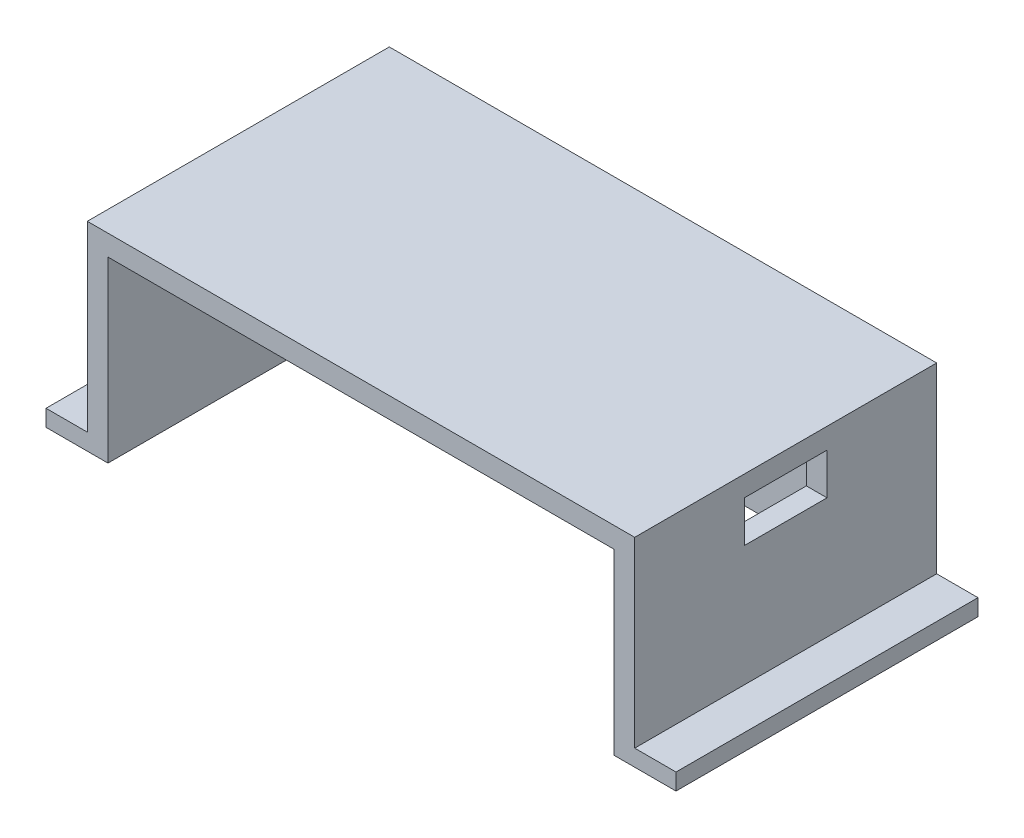
ISO-10303-21;
HEADER;
FILE_DESCRIPTION(('STEP AP214'),'2;1');
FILE_NAME('part.step','',(''),(''),'','','');
FILE_SCHEMA(('AUTOMOTIVE_DESIGN { 1 0 10303 214 1 1 1 1 }'));
ENDSEC;
DATA;
#1=APPLICATION_CONTEXT('core data for automotive mechanical design processes');
#2=APPLICATION_PROTOCOL_DEFINITION('international standard','automotive_design',2000,#1);
#3=PRODUCT_CONTEXT('',#1,'mechanical');
#4=PRODUCT('Part','Part','',(#3));
#5=PRODUCT_RELATED_PRODUCT_CATEGORY('part','',(#4));
#6=PRODUCT_DEFINITION_FORMATION('','',#4);
#7=PRODUCT_DEFINITION_CONTEXT('part definition',#1,'design');
#8=PRODUCT_DEFINITION('design','',#6,#7);
#9=PRODUCT_DEFINITION_SHAPE('','',#8);
#10=(LENGTH_UNIT() NAMED_UNIT(*) SI_UNIT(.MILLI.,.METRE.));
#11=(NAMED_UNIT(*) PLANE_ANGLE_UNIT() SI_UNIT($,.RADIAN.));
#12=(NAMED_UNIT(*) SI_UNIT($,.STERADIAN.) SOLID_ANGLE_UNIT());
#13=UNCERTAINTY_MEASURE_WITH_UNIT(LENGTH_MEASURE(1.E-05),#10,'distance_accuracy_value','');
#14=(GEOMETRIC_REPRESENTATION_CONTEXT(3) GLOBAL_UNCERTAINTY_ASSIGNED_CONTEXT((#13)) GLOBAL_UNIT_ASSIGNED_CONTEXT((#10,
#11,#12)) REPRESENTATION_CONTEXT('',''));
#15=CARTESIAN_POINT('',(0.,0.,0.));
#16=DIRECTION('',(0.,0.,1.));
#17=DIRECTION('',(1.,0.,0.));
#18=AXIS2_PLACEMENT_3D('',#15,#16,#17);
#19=CARTESIAN_POINT('',(-66.25,48.2,-36.55));
#20=DIRECTION('',(1.,0.,0.));
#21=DIRECTION('',(0.,0.,-1.));
#22=AXIS2_PLACEMENT_3D('',#19,#20,#21);
#23=PLANE('',#22);
#24=DIRECTION('',(0.,0.,-1.));
#25=VECTOR('',#24,1.);
#26=CARTESIAN_POINT('',(-66.25,4.,-36.55));
#27=LINE('',#26,#25);
#28=CARTESIAN_POINT('',(-66.25,4.,36.55));
#29=VERTEX_POINT('',#28);
#30=CARTESIAN_POINT('',(-66.25,4.,-36.55));
#31=VERTEX_POINT('',#30);
#32=EDGE_CURVE('E47',#29,#31,#27,.T.);
#33=ORIENTED_EDGE('',*,*,#32,.F.);
#34=DIRECTION('',(0.,-1.,0.));
#35=VECTOR('',#34,1.);
#36=CARTESIAN_POINT('',(-66.25,48.2,36.55));
#37=LINE('',#36,#35);
#38=CARTESIAN_POINT('',(-66.25,48.2,36.55));
#39=VERTEX_POINT('',#38);
#40=EDGE_CURVE('E266',#39,#29,#37,.T.);
#41=ORIENTED_EDGE('',*,*,#40,.F.);
#42=DIRECTION('',(0.,0.,1.));
#43=VECTOR('',#42,1.);
#44=CARTESIAN_POINT('',(-66.25,48.2,-36.55));
#45=LINE('',#44,#43);
#46=CARTESIAN_POINT('',(-66.25,48.2,-36.55));
#47=VERTEX_POINT('',#46);
#48=EDGE_CURVE('E157',#47,#39,#45,.T.);
#49=ORIENTED_EDGE('',*,*,#48,.F.);
#50=DIRECTION('',(0.,-1.,0.));
#51=VECTOR('',#50,1.);
#52=CARTESIAN_POINT('',(-66.25,48.2,-36.55));
#53=LINE('',#52,#51);
#54=EDGE_CURVE('E259',#47,#31,#53,.T.);
#55=ORIENTED_EDGE('',*,*,#54,.T.);
#56=EDGE_LOOP('',(#33,#41,#49,#55));
#57=FACE_BOUND('',#56,.T.);
#58=ADVANCED_FACE('F33',(#57),#23,.F.);
#59=CARTESIAN_POINT('',(-66.25,48.2,36.55));
#60=DIRECTION('',(0.,0.,-1.));
#61=DIRECTION('',(-1.,0.,0.));
#62=AXIS2_PLACEMENT_3D('',#59,#60,#61);
#63=PLANE('',#62);
#64=DIRECTION('',(1.,0.,0.));
#65=VECTOR('',#64,1.);
#66=CARTESIAN_POINT('',(-66.25,0.,36.55));
#67=LINE('',#66,#65);
#68=CARTESIAN_POINT('',(-76.25,0.,36.55));
#69=VERTEX_POINT('',#68);
#70=CARTESIAN_POINT('',(-61.25,0.,36.55));
#71=VERTEX_POINT('',#70);
#72=EDGE_CURVE('E158',#69,#71,#67,.T.);
#73=ORIENTED_EDGE('',*,*,#72,.T.);
#74=DIRECTION('',(0.,-1.,0.));
#75=VECTOR('',#74,1.);
#76=CARTESIAN_POINT('',(-61.25,0.,36.55));
#77=LINE('',#76,#75);
#78=CARTESIAN_POINT('',(-61.25,43.2,36.55));
#79=VERTEX_POINT('',#78);
#80=EDGE_CURVE('E213',#79,#71,#77,.T.);
#81=ORIENTED_EDGE('',*,*,#80,.F.);
#82=DIRECTION('',(-1.,0.,0.));
#83=VECTOR('',#82,1.);
#84=CARTESIAN_POINT('',(-61.25,43.2,36.55));
#85=LINE('',#84,#83);
#86=CARTESIAN_POINT('',(61.25,43.2,36.55));
#87=VERTEX_POINT('',#86);
#88=EDGE_CURVE('E223',#87,#79,#85,.T.);
#89=ORIENTED_EDGE('',*,*,#88,.F.);
#90=DIRECTION('',(0.,1.,0.));
#91=VECTOR('',#90,1.);
#92=CARTESIAN_POINT('',(61.25,0.,36.55));
#93=LINE('',#92,#91);
#94=CARTESIAN_POINT('',(61.25,0.,36.55));
#95=VERTEX_POINT('',#94);
#96=EDGE_CURVE('E234',#95,#87,#93,.T.);
#97=ORIENTED_EDGE('',*,*,#96,.F.);
#98=CARTESIAN_POINT('',(76.25,0.,36.55));
#99=VERTEX_POINT('',#98);
#100=EDGE_CURVE('E241',#95,#99,#67,.T.);
#101=ORIENTED_EDGE('',*,*,#100,.T.);
#102=DIRECTION('',(0.,-1.,0.));
#103=VECTOR('',#102,1.);
#104=CARTESIAN_POINT('',(76.25,0.,36.55));
#105=LINE('',#104,#103);
#106=CARTESIAN_POINT('',(76.25,4.,36.55));
#107=VERTEX_POINT('',#106);
#108=EDGE_CURVE('E184',#107,#99,#105,.T.);
#109=ORIENTED_EDGE('',*,*,#108,.F.);
#110=DIRECTION('',(-1.,0.,0.));
#111=VECTOR('',#110,1.);
#112=CARTESIAN_POINT('',(76.25,4.,36.55));
#113=LINE('',#112,#111);
#114=CARTESIAN_POINT('',(66.25,4.,36.55));
#115=VERTEX_POINT('',#114);
#116=EDGE_CURVE('E192',#107,#115,#113,.T.);
#117=ORIENTED_EDGE('',*,*,#116,.T.);
#118=DIRECTION('',(0.,-1.,0.));
#119=VECTOR('',#118,1.);
#120=CARTESIAN_POINT('',(66.25,48.2,36.55));
#121=LINE('',#120,#119);
#122=CARTESIAN_POINT('',(66.25,48.2,36.55));
#123=VERTEX_POINT('',#122);
#124=EDGE_CURVE('E264',#123,#115,#121,.T.);
#125=ORIENTED_EDGE('',*,*,#124,.F.);
#126=DIRECTION('',(1.,0.,0.));
#127=VECTOR('',#126,1.);
#128=CARTESIAN_POINT('',(-66.25,48.2,36.55));
#129=LINE('',#128,#127);
#130=EDGE_CURVE('E251',#39,#123,#129,.T.);
#131=ORIENTED_EDGE('',*,*,#130,.F.);
#132=ORIENTED_EDGE('',*,*,#40,.T.);
#133=DIRECTION('',(1.,0.,0.));
#134=VECTOR('',#133,1.);
#135=CARTESIAN_POINT('',(-76.25,4.,36.55));
#136=LINE('',#135,#134);
#137=CARTESIAN_POINT('',(-76.25,4.,36.55));
#138=VERTEX_POINT('',#137);
#139=EDGE_CURVE('E181',#138,#29,#136,.T.);
#140=ORIENTED_EDGE('',*,*,#139,.F.);
#141=DIRECTION('',(0.,1.,0.));
#142=VECTOR('',#141,1.);
#143=CARTESIAN_POINT('',(-76.25,0.,36.55));
#144=LINE('',#143,#142);
#145=EDGE_CURVE('E168',#69,#138,#144,.T.);
#146=ORIENTED_EDGE('',*,*,#145,.F.);
#147=EDGE_LOOP('',(#73,#81,#89,#97,#101,#109,#117,#125,#131,#132,#140,#146));
#148=FACE_BOUND('',#147,.T.);
#149=ADVANCED_FACE('F301',(#148),#63,.F.);
#150=CARTESIAN_POINT('',(66.25,48.2,-36.55));
#151=DIRECTION('',(1.,0.,0.));
#152=DIRECTION('',(0.,0.,-1.));
#153=AXIS2_PLACEMENT_3D('',#150,#151,#152);
#154=PLANE('',#153);
#155=DIRECTION('',(0.,0.,1.));
#156=VECTOR('',#155,1.);
#157=CARTESIAN_POINT('',(66.25,4.,36.55));
#158=LINE('',#157,#156);
#159=CARTESIAN_POINT('',(66.25,4.,-36.55));
#160=VERTEX_POINT('',#159);
#161=EDGE_CURVE('E55',#160,#115,#158,.T.);
#162=ORIENTED_EDGE('',*,*,#161,.F.);
#163=DIRECTION('',(0.,-1.,0.));
#164=VECTOR('',#163,1.);
#165=CARTESIAN_POINT('',(66.25,48.2,-36.55));
#166=LINE('',#165,#164);
#167=CARTESIAN_POINT('',(66.25,48.2,-36.55));
#168=VERTEX_POINT('',#167);
#169=EDGE_CURVE('E262',#168,#160,#166,.T.);
#170=ORIENTED_EDGE('',*,*,#169,.F.);
#171=DIRECTION('',(0.,0.,1.));
#172=VECTOR('',#171,1.);
#173=CARTESIAN_POINT('',(66.25,48.2,-36.55));
#174=LINE('',#173,#172);
#175=EDGE_CURVE('E253',#168,#123,#174,.T.);
#176=ORIENTED_EDGE('',*,*,#175,.T.);
#177=ORIENTED_EDGE('',*,*,#124,.T.);
#178=EDGE_LOOP('',(#162,#170,#176,#177));
#179=FACE_BOUND('',#178,.T.);
#180=DIRECTION('',(0.,1.,0.));
#181=VECTOR('',#180,1.);
#182=CARTESIAN_POINT('',(66.25,43.2,-10.));
#183=LINE('',#182,#181);
#184=CARTESIAN_POINT('',(66.25,33.2,-10.));
#185=VERTEX_POINT('',#184);
#186=CARTESIAN_POINT('',(66.25,43.2,-10.));
#187=VERTEX_POINT('',#186);
#188=EDGE_CURVE('E199',#185,#187,#183,.T.);
#189=ORIENTED_EDGE('',*,*,#188,.F.);
#190=DIRECTION('',(0.,0.,-1.));
#191=VECTOR('',#190,1.);
#192=CARTESIAN_POINT('',(66.25,33.2,10.));
#193=LINE('',#192,#191);
#194=CARTESIAN_POINT('',(66.25,33.2,10.));
#195=VERTEX_POINT('',#194);
#196=EDGE_CURVE('E207',#195,#185,#193,.T.);
#197=ORIENTED_EDGE('',*,*,#196,.F.);
#198=DIRECTION('',(0.,-1.,0.));
#199=VECTOR('',#198,1.);
#200=CARTESIAN_POINT('',(66.25,43.2,10.));
#201=LINE('',#200,#199);
#202=CARTESIAN_POINT('',(66.25,43.2,10.));
#203=VERTEX_POINT('',#202);
#204=EDGE_CURVE('E204',#203,#195,#201,.T.);
#205=ORIENTED_EDGE('',*,*,#204,.F.);
#206=DIRECTION('',(0.,0.,1.));
#207=VECTOR('',#206,1.);
#208=CARTESIAN_POINT('',(66.25,43.2,10.));
#209=LINE('',#208,#207);
#210=EDGE_CURVE('E201',#187,#203,#209,.T.);
#211=ORIENTED_EDGE('',*,*,#210,.F.);
#212=EDGE_LOOP('',(#189,#197,#205,#211));
#213=FACE_BOUND('',#212,.T.);
#214=ADVANCED_FACE('F286',(#179,#213),#154,.T.);
#215=CARTESIAN_POINT('',(-66.25,48.2,-36.55));
#216=DIRECTION('',(0.,0.,-1.));
#217=DIRECTION('',(-1.,0.,0.));
#218=AXIS2_PLACEMENT_3D('',#215,#216,#217);
#219=PLANE('',#218);
#220=DIRECTION('',(1.,0.,0.));
#221=VECTOR('',#220,1.);
#222=CARTESIAN_POINT('',(-66.25,0.,-36.55));
#223=LINE('',#222,#221);
#224=CARTESIAN_POINT('',(-76.25,0.,-36.55));
#225=VERTEX_POINT('',#224);
#226=CARTESIAN_POINT('',(76.25,0.,-36.55));
#227=VERTEX_POINT('',#226);
#228=EDGE_CURVE('E146',#225,#227,#223,.T.);
#229=ORIENTED_EDGE('',*,*,#228,.F.);
#230=DIRECTION('',(0.,-1.,0.));
#231=VECTOR('',#230,1.);
#232=CARTESIAN_POINT('',(-76.25,0.,-36.55));
#233=LINE('',#232,#231);
#234=CARTESIAN_POINT('',(-76.25,4.,-36.55));
#235=VERTEX_POINT('',#234);
#236=EDGE_CURVE('E151',#235,#225,#233,.T.);
#237=ORIENTED_EDGE('',*,*,#236,.F.);
#238=DIRECTION('',(1.,0.,0.));
#239=VECTOR('',#238,1.);
#240=CARTESIAN_POINT('',(-76.25,4.,-36.55));
#241=LINE('',#240,#239);
#242=EDGE_CURVE('E178',#235,#31,#241,.T.);
#243=ORIENTED_EDGE('',*,*,#242,.T.);
#244=ORIENTED_EDGE('',*,*,#54,.F.);
#245=DIRECTION('',(1.,0.,0.));
#246=VECTOR('',#245,1.);
#247=CARTESIAN_POINT('',(-66.25,48.2,-36.55));
#248=LINE('',#247,#246);
#249=EDGE_CURVE('E256',#47,#168,#248,.T.);
#250=ORIENTED_EDGE('',*,*,#249,.T.);
#251=ORIENTED_EDGE('',*,*,#169,.T.);
#252=DIRECTION('',(-1.,0.,0.));
#253=VECTOR('',#252,1.);
#254=CARTESIAN_POINT('',(76.25,4.,-36.55));
#255=LINE('',#254,#253);
#256=CARTESIAN_POINT('',(76.25,4.,-36.55));
#257=VERTEX_POINT('',#256);
#258=EDGE_CURVE('E196',#257,#160,#255,.T.);
#259=ORIENTED_EDGE('',*,*,#258,.F.);
#260=DIRECTION('',(0.,1.,0.));
#261=VECTOR('',#260,1.);
#262=CARTESIAN_POINT('',(76.25,0.,-36.55));
#263=LINE('',#262,#261);
#264=EDGE_CURVE('E153',#227,#257,#263,.T.);
#265=ORIENTED_EDGE('',*,*,#264,.F.);
#266=EDGE_LOOP('',(#229,#237,#243,#244,#250,#251,#259,#265));
#267=FACE_BOUND('',#266,.T.);
#268=ADVANCED_FACE('F148',(#267),#219,.T.);
#269=CARTESIAN_POINT('',(0.,48.2,0.));
#270=DIRECTION('',(0.,1.,0.));
#271=DIRECTION('',(0.,0.,1.));
#272=AXIS2_PLACEMENT_3D('',#269,#270,#271);
#273=PLANE('',#272);
#274=ORIENTED_EDGE('',*,*,#48,.T.);
#275=ORIENTED_EDGE('',*,*,#130,.T.);
#276=ORIENTED_EDGE('',*,*,#175,.F.);
#277=ORIENTED_EDGE('',*,*,#249,.F.);
#278=EDGE_LOOP('',(#274,#275,#276,#277));
#279=FACE_BOUND('',#278,.T.);
#280=ADVANCED_FACE('F313',(#279),#273,.T.);
#281=CARTESIAN_POINT('',(0.,0.,0.));
#282=DIRECTION('',(0.,1.,0.));
#283=DIRECTION('',(0.,0.,1.));
#284=AXIS2_PLACEMENT_3D('',#281,#282,#283);
#285=PLANE('',#284);
#286=DIRECTION('',(1.,0.,0.));
#287=VECTOR('',#286,1.);
#288=CARTESIAN_POINT('',(-61.25,0.,-31.55));
#289=LINE('',#288,#287);
#290=CARTESIAN_POINT('',(-61.25,0.,-31.55));
#291=VERTEX_POINT('',#290);
#292=CARTESIAN_POINT('',(61.25,0.,-31.55));
#293=VERTEX_POINT('',#292);
#294=EDGE_CURVE('E222',#291,#293,#289,.T.);
#295=ORIENTED_EDGE('',*,*,#294,.F.);
#296=DIRECTION('',(0.,0.,1.));
#297=VECTOR('',#296,1.);
#298=CARTESIAN_POINT('',(-61.25,0.,-31.55));
#299=LINE('',#298,#297);
#300=EDGE_CURVE('E232',#291,#71,#299,.T.);
#301=ORIENTED_EDGE('',*,*,#300,.T.);
#302=ORIENTED_EDGE('',*,*,#72,.F.);
#303=DIRECTION('',(0.,0.,1.));
#304=VECTOR('',#303,1.);
#305=CARTESIAN_POINT('',(-76.25,0.,-36.55));
#306=LINE('',#305,#304);
#307=EDGE_CURVE('E161',#225,#69,#306,.T.);
#308=ORIENTED_EDGE('',*,*,#307,.F.);
#309=ORIENTED_EDGE('',*,*,#228,.T.);
#310=DIRECTION('',(0.,0.,-1.));
#311=VECTOR('',#310,1.);
#312=CARTESIAN_POINT('',(76.25,0.,36.55));
#313=LINE('',#312,#311);
#314=EDGE_CURVE('E187',#99,#227,#313,.T.);
#315=ORIENTED_EDGE('',*,*,#314,.F.);
#316=ORIENTED_EDGE('',*,*,#100,.F.);
#317=DIRECTION('',(0.,0.,1.));
#318=VECTOR('',#317,1.);
#319=CARTESIAN_POINT('',(61.25,0.,-31.55));
#320=LINE('',#319,#318);
#321=EDGE_CURVE('E246',#293,#95,#320,.T.);
#322=ORIENTED_EDGE('',*,*,#321,.F.);
#323=EDGE_LOOP('',(#295,#301,#302,#308,#309,#315,#316,#322));
#324=FACE_BOUND('',#323,.T.);
#325=ADVANCED_FACE('F163',(#324),#285,.F.);
#326=CARTESIAN_POINT('',(-61.25,0.,-31.55));
#327=DIRECTION('',(-1.,0.,0.));
#328=DIRECTION('',(0.,0.,1.));
#329=AXIS2_PLACEMENT_3D('',#326,#327,#328);
#330=PLANE('',#329);
#331=ORIENTED_EDGE('',*,*,#80,.T.);
#332=ORIENTED_EDGE('',*,*,#300,.F.);
#333=DIRECTION('',(0.,-1.,0.));
#334=VECTOR('',#333,1.);
#335=CARTESIAN_POINT('',(-61.25,0.,-31.55));
#336=LINE('',#335,#334);
#337=CARTESIAN_POINT('',(-61.25,43.2,-31.55));
#338=VERTEX_POINT('',#337);
#339=EDGE_CURVE('E220',#338,#291,#336,.T.);
#340=ORIENTED_EDGE('',*,*,#339,.F.);
#341=DIRECTION('',(0.,0.,1.));
#342=VECTOR('',#341,1.);
#343=CARTESIAN_POINT('',(-61.25,43.2,-31.55));
#344=LINE('',#343,#342);
#345=EDGE_CURVE('E239',#338,#79,#344,.T.);
#346=ORIENTED_EDGE('',*,*,#345,.T.);
#347=EDGE_LOOP('',(#331,#332,#340,#346));
#348=FACE_BOUND('',#347,.T.);
#349=ADVANCED_FACE('F305',(#348),#330,.F.);
#350=CARTESIAN_POINT('',(-61.25,43.2,-31.55));
#351=DIRECTION('',(0.,1.,0.));
#352=DIRECTION('',(0.,0.,1.));
#353=AXIS2_PLACEMENT_3D('',#350,#351,#352);
#354=PLANE('',#353);
#355=DIRECTION('',(1.,0.,0.));
#356=VECTOR('',#355,1.);
#357=CARTESIAN_POINT('',(56.25,43.2,10.));
#358=LINE('',#357,#356);
#359=CARTESIAN_POINT('',(61.25,43.2,9.99999999999999));
#360=VERTEX_POINT('',#359);
#361=EDGE_CURVE('E216',#360,#203,#358,.T.);
#362=ORIENTED_EDGE('',*,*,#361,.F.);
#363=DIRECTION('',(0.,0.,1.));
#364=VECTOR('',#363,1.);
#365=CARTESIAN_POINT('',(61.25,43.2,-31.55));
#366=LINE('',#365,#364);
#367=EDGE_CURVE('E245',#360,#87,#366,.T.);
#368=ORIENTED_EDGE('',*,*,#367,.T.);
#369=ORIENTED_EDGE('',*,*,#88,.T.);
#370=ORIENTED_EDGE('',*,*,#345,.F.);
#371=DIRECTION('',(-1.,0.,0.));
#372=VECTOR('',#371,1.);
#373=CARTESIAN_POINT('',(-61.25,43.2,-31.55));
#374=LINE('',#373,#372);
#375=CARTESIAN_POINT('',(61.25,43.2,-31.55));
#376=VERTEX_POINT('',#375);
#377=EDGE_CURVE('E229',#376,#338,#374,.T.);
#378=ORIENTED_EDGE('',*,*,#377,.F.);
#379=CARTESIAN_POINT('',(61.25,43.2,-10.));
#380=VERTEX_POINT('',#379);
#381=EDGE_CURVE('E242',#376,#380,#366,.T.);
#382=ORIENTED_EDGE('',*,*,#381,.T.);
#383=DIRECTION('',(1.,0.,0.));
#384=VECTOR('',#383,1.);
#385=CARTESIAN_POINT('',(56.25,43.2,-10.));
#386=LINE('',#385,#384);
#387=EDGE_CURVE('E210',#380,#187,#386,.T.);
#388=ORIENTED_EDGE('',*,*,#387,.T.);
#389=ORIENTED_EDGE('',*,*,#210,.T.);
#390=EDGE_LOOP('',(#362,#368,#369,#370,#378,#382,#388,#389));
#391=FACE_BOUND('',#390,.T.);
#392=ADVANCED_FACE('F290',(#391),#354,.F.);
#393=CARTESIAN_POINT('',(61.25,0.,-31.55));
#394=DIRECTION('',(1.,0.,0.));
#395=DIRECTION('',(0.,1.,0.));
#396=AXIS2_PLACEMENT_3D('',#393,#394,#395);
#397=PLANE('',#396);
#398=DIRECTION('',(0.,0.,-1.));
#399=VECTOR('',#398,1.);
#400=CARTESIAN_POINT('',(61.25,33.2,-31.55));
#401=LINE('',#400,#399);
#402=CARTESIAN_POINT('',(61.25,33.2,10.));
#403=VERTEX_POINT('',#402);
#404=CARTESIAN_POINT('',(61.25,33.2,-10.));
#405=VERTEX_POINT('',#404);
#406=EDGE_CURVE('E40',#403,#405,#401,.T.);
#407=ORIENTED_EDGE('',*,*,#406,.T.);
#408=DIRECTION('',(0.,1.,0.));
#409=VECTOR('',#408,1.);
#410=CARTESIAN_POINT('',(61.25,0.,-10.));
#411=LINE('',#410,#409);
#412=EDGE_CURVE('E11',#405,#380,#411,.T.);
#413=ORIENTED_EDGE('',*,*,#412,.T.);
#414=ORIENTED_EDGE('',*,*,#381,.F.);
#415=DIRECTION('',(0.,1.,0.));
#416=VECTOR('',#415,1.);
#417=CARTESIAN_POINT('',(61.25,0.,-31.55));
#418=LINE('',#417,#416);
#419=EDGE_CURVE('E226',#293,#376,#418,.T.);
#420=ORIENTED_EDGE('',*,*,#419,.F.);
#421=ORIENTED_EDGE('',*,*,#321,.T.);
#422=ORIENTED_EDGE('',*,*,#96,.T.);
#423=ORIENTED_EDGE('',*,*,#367,.F.);
#424=DIRECTION('',(0.,-1.,0.));
#425=VECTOR('',#424,1.);
#426=CARTESIAN_POINT('',(61.25,0.,10.));
#427=LINE('',#426,#425);
#428=EDGE_CURVE('E268',#360,#403,#427,.T.);
#429=ORIENTED_EDGE('',*,*,#428,.T.);
#430=EDGE_LOOP('',(#407,#413,#414,#420,#421,#422,#423,#429));
#431=FACE_BOUND('',#430,.T.);
#432=ADVANCED_FACE('F272',(#431),#397,.F.);
#433=CARTESIAN_POINT('',(0.,0.,-31.55));
#434=DIRECTION('',(0.,0.,-1.));
#435=DIRECTION('',(-1.,0.,0.));
#436=AXIS2_PLACEMENT_3D('',#433,#434,#435);
#437=PLANE('',#436);
#438=ORIENTED_EDGE('',*,*,#339,.T.);
#439=ORIENTED_EDGE('',*,*,#294,.T.);
#440=ORIENTED_EDGE('',*,*,#419,.T.);
#441=ORIENTED_EDGE('',*,*,#377,.T.);
#442=EDGE_LOOP('',(#438,#439,#440,#441));
#443=FACE_BOUND('',#442,.T.);
#444=ADVANCED_FACE('F293',(#443),#437,.F.);
#445=CARTESIAN_POINT('',(56.25,43.2,-10.));
#446=DIRECTION('',(0.,0.,-1.));
#447=DIRECTION('',(-1.,0.,0.));
#448=AXIS2_PLACEMENT_3D('',#445,#446,#447);
#449=PLANE('',#448);
#450=DIRECTION('',(1.,0.,0.));
#451=VECTOR('',#450,1.);
#452=CARTESIAN_POINT('',(56.25,33.2,-10.));
#453=LINE('',#452,#451);
#454=EDGE_CURVE('E211',#405,#185,#453,.T.);
#455=ORIENTED_EDGE('',*,*,#454,.T.);
#456=ORIENTED_EDGE('',*,*,#188,.T.);
#457=ORIENTED_EDGE('',*,*,#387,.F.);
#458=ORIENTED_EDGE('',*,*,#412,.F.);
#459=EDGE_LOOP('',(#455,#456,#457,#458));
#460=FACE_BOUND('',#459,.T.);
#461=ADVANCED_FACE('F288',(#460),#449,.F.);
#462=CARTESIAN_POINT('',(56.25,33.2,10.));
#463=DIRECTION('',(0.,-1.,0.));
#464=DIRECTION('',(0.,0.,-1.));
#465=AXIS2_PLACEMENT_3D('',#462,#463,#464);
#466=PLANE('',#465);
#467=DIRECTION('',(1.,0.,0.));
#468=VECTOR('',#467,1.);
#469=CARTESIAN_POINT('',(56.25,33.2,10.));
#470=LINE('',#469,#468);
#471=EDGE_CURVE('E214',#403,#195,#470,.T.);
#472=ORIENTED_EDGE('',*,*,#471,.T.);
#473=ORIENTED_EDGE('',*,*,#196,.T.);
#474=ORIENTED_EDGE('',*,*,#454,.F.);
#475=ORIENTED_EDGE('',*,*,#406,.F.);
#476=EDGE_LOOP('',(#472,#473,#474,#475));
#477=FACE_BOUND('',#476,.T.);
#478=ADVANCED_FACE('F278',(#477),#466,.F.);
#479=CARTESIAN_POINT('',(56.25,43.2,10.));
#480=DIRECTION('',(0.,0.,1.));
#481=DIRECTION('',(1.,0.,0.));
#482=AXIS2_PLACEMENT_3D('',#479,#480,#481);
#483=PLANE('',#482);
#484=ORIENTED_EDGE('',*,*,#361,.T.);
#485=ORIENTED_EDGE('',*,*,#204,.T.);
#486=ORIENTED_EDGE('',*,*,#471,.F.);
#487=ORIENTED_EDGE('',*,*,#428,.F.);
#488=EDGE_LOOP('',(#484,#485,#486,#487));
#489=FACE_BOUND('',#488,.T.);
#490=ADVANCED_FACE('F280',(#489),#483,.F.);
#491=CARTESIAN_POINT('',(76.25,4.,36.55));
#492=DIRECTION('',(0.,-1.,0.));
#493=DIRECTION('',(0.,0.,-1.));
#494=AXIS2_PLACEMENT_3D('',#491,#492,#493);
#495=PLANE('',#494);
#496=ORIENTED_EDGE('',*,*,#161,.T.);
#497=ORIENTED_EDGE('',*,*,#116,.F.);
#498=DIRECTION('',(0.,0.,1.));
#499=VECTOR('',#498,1.);
#500=CARTESIAN_POINT('',(76.25,4.,36.55));
#501=LINE('',#500,#499);
#502=EDGE_CURVE('E190',#257,#107,#501,.T.);
#503=ORIENTED_EDGE('',*,*,#502,.F.);
#504=ORIENTED_EDGE('',*,*,#258,.T.);
#505=EDGE_LOOP('',(#496,#497,#503,#504));
#506=FACE_BOUND('',#505,.T.);
#507=ADVANCED_FACE('F317',(#506),#495,.F.);
#508=CARTESIAN_POINT('',(76.25,0.,0.));
#509=DIRECTION('',(-1.,0.,0.));
#510=DIRECTION('',(0.,0.,1.));
#511=AXIS2_PLACEMENT_3D('',#508,#509,#510);
#512=PLANE('',#511);
#513=ORIENTED_EDGE('',*,*,#108,.T.);
#514=ORIENTED_EDGE('',*,*,#314,.T.);
#515=ORIENTED_EDGE('',*,*,#264,.T.);
#516=ORIENTED_EDGE('',*,*,#502,.T.);
#517=EDGE_LOOP('',(#513,#514,#515,#516));
#518=FACE_BOUND('',#517,.T.);
#519=ADVANCED_FACE('F320',(#518),#512,.F.);
#520=CARTESIAN_POINT('',(-76.25,4.,-36.55));
#521=DIRECTION('',(0.,-1.,0.));
#522=DIRECTION('',(0.,0.,-1.));
#523=AXIS2_PLACEMENT_3D('',#520,#521,#522);
#524=PLANE('',#523);
#525=ORIENTED_EDGE('',*,*,#32,.T.);
#526=ORIENTED_EDGE('',*,*,#242,.F.);
#527=DIRECTION('',(0.,0.,-1.));
#528=VECTOR('',#527,1.);
#529=CARTESIAN_POINT('',(-76.25,4.,-36.55));
#530=LINE('',#529,#528);
#531=EDGE_CURVE('E172',#138,#235,#530,.T.);
#532=ORIENTED_EDGE('',*,*,#531,.F.);
#533=ORIENTED_EDGE('',*,*,#139,.T.);
#534=EDGE_LOOP('',(#525,#526,#532,#533));
#535=FACE_BOUND('',#534,.T.);
#536=ADVANCED_FACE('F308',(#535),#524,.F.);
#537=CARTESIAN_POINT('',(-76.25,0.,0.));
#538=DIRECTION('',(1.,0.,0.));
#539=DIRECTION('',(0.,0.,-1.));
#540=AXIS2_PLACEMENT_3D('',#537,#538,#539);
#541=PLANE('',#540);
#542=ORIENTED_EDGE('',*,*,#236,.T.);
#543=ORIENTED_EDGE('',*,*,#307,.T.);
#544=ORIENTED_EDGE('',*,*,#145,.T.);
#545=ORIENTED_EDGE('',*,*,#531,.T.);
#546=EDGE_LOOP('',(#542,#543,#544,#545));
#547=FACE_BOUND('',#546,.T.);
#548=ADVANCED_FACE('F170',(#547),#541,.F.);
#549=CLOSED_SHELL('',(#58,#149,#214,#268,#280,#325,#349,#392,#432,#444,#461,#478,#490,#507,#519,
#536,#548));
#550=MANIFOLD_SOLID_BREP('B2',#549);
#551=ADVANCED_BREP_SHAPE_REPRESENTATION('',(#18,#550),#14);
#552=SHAPE_DEFINITION_REPRESENTATION(#9,#551);
ENDSEC;
END-ISO-10303-21;
